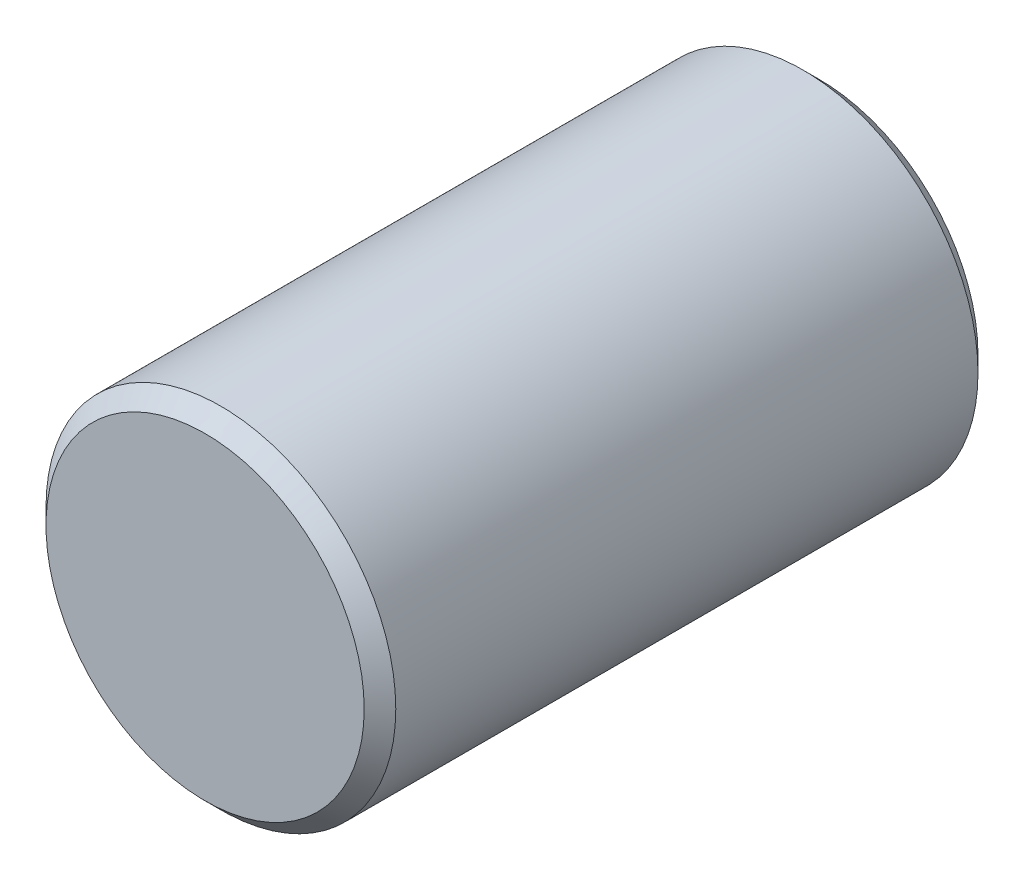
ISO-10303-21;
HEADER;
FILE_DESCRIPTION(('STEP AP214'),'2;1');
FILE_NAME('part.step','',(''),(''),'','','');
FILE_SCHEMA(('AUTOMOTIVE_DESIGN { 1 0 10303 214 1 1 1 1 }'));
ENDSEC;
DATA;
#1=APPLICATION_CONTEXT('core data for automotive mechanical design processes');
#2=APPLICATION_PROTOCOL_DEFINITION('international standard','automotive_design',2000,#1);
#3=PRODUCT_CONTEXT('',#1,'mechanical');
#4=PRODUCT('Part','Part','',(#3));
#5=PRODUCT_RELATED_PRODUCT_CATEGORY('part','',(#4));
#6=PRODUCT_DEFINITION_FORMATION('','',#4);
#7=PRODUCT_DEFINITION_CONTEXT('part definition',#1,'design');
#8=PRODUCT_DEFINITION('design','',#6,#7);
#9=PRODUCT_DEFINITION_SHAPE('','',#8);
#10=(LENGTH_UNIT() NAMED_UNIT(*) SI_UNIT(.MILLI.,.METRE.));
#11=(NAMED_UNIT(*) PLANE_ANGLE_UNIT() SI_UNIT($,.RADIAN.));
#12=(NAMED_UNIT(*) SI_UNIT($,.STERADIAN.) SOLID_ANGLE_UNIT());
#13=UNCERTAINTY_MEASURE_WITH_UNIT(LENGTH_MEASURE(1.E-05),#10,'distance_accuracy_value','');
#14=(GEOMETRIC_REPRESENTATION_CONTEXT(3) GLOBAL_UNCERTAINTY_ASSIGNED_CONTEXT((#13)) GLOBAL_UNIT_ASSIGNED_CONTEXT((#10,
#11,#12)) REPRESENTATION_CONTEXT('',''));
#15=CARTESIAN_POINT('',(0.,0.,0.));
#16=DIRECTION('',(0.,0.,1.));
#17=DIRECTION('',(1.,0.,0.));
#18=AXIS2_PLACEMENT_3D('',#15,#16,#17);
#19=CARTESIAN_POINT('',(0.,0.,13.6));
#20=DIRECTION('',(0.,0.,-1.));
#21=DIRECTION('',(-1.,0.,0.));
#22=AXIS2_PLACEMENT_3D('',#19,#20,#21);
#23=CYLINDRICAL_SURFACE('',#22,3.875);
#24=CARTESIAN_POINT('',(0.,0.,0.350000000000001));
#25=DIRECTION('',(0.,0.,1.));
#26=DIRECTION('',(1.,0.,0.));
#27=AXIS2_PLACEMENT_3D('',#24,#25,#26);
#28=CIRCLE('',#27,3.875);
#29=CARTESIAN_POINT('',(3.875,0.,0.350000000000001));
#30=VERTEX_POINT('',#29);
#31=EDGE_CURVE('E42',#30,#30,#28,.T.);
#32=ORIENTED_EDGE('',*,*,#31,.T.);
#33=EDGE_LOOP('',(#32));
#34=FACE_BOUND('',#33,.T.);
#35=CARTESIAN_POINT('',(0.,0.,13.25));
#36=DIRECTION('',(0.,0.,1.));
#37=DIRECTION('',(1.,0.,0.));
#38=AXIS2_PLACEMENT_3D('',#35,#36,#37);
#39=CIRCLE('',#38,3.875);
#40=CARTESIAN_POINT('',(3.875,0.,13.25));
#41=VERTEX_POINT('',#40);
#42=EDGE_CURVE('E46',#41,#41,#39,.F.);
#43=ORIENTED_EDGE('',*,*,#42,.T.);
#44=EDGE_LOOP('',(#43));
#45=FACE_BOUND('',#44,.T.);
#46=ADVANCED_FACE('F31',(#34,#45),#23,.T.);
#47=CARTESIAN_POINT('',(0.,0.,13.6));
#48=DIRECTION('',(0.,0.,1.));
#49=DIRECTION('',(1.,0.,0.));
#50=AXIS2_PLACEMENT_3D('',#47,#48,#49);
#51=PLANE('',#50);
#52=CARTESIAN_POINT('',(0.,0.,13.6));
#53=DIRECTION('',(0.,0.,1.));
#54=DIRECTION('',(1.,0.,0.));
#55=AXIS2_PLACEMENT_3D('',#52,#53,#54);
#56=CIRCLE('',#55,3.525);
#57=CARTESIAN_POINT('',(3.525,0.,13.6));
#58=VERTEX_POINT('',#57);
#59=EDGE_CURVE('E10',#58,#58,#56,.T.);
#60=ORIENTED_EDGE('',*,*,#59,.T.);
#61=EDGE_LOOP('',(#60));
#62=FACE_BOUND('',#61,.T.);
#63=ADVANCED_FACE('F62',(#62),#51,.T.);
#64=CARTESIAN_POINT('',(0.,0.,0.));
#65=DIRECTION('',(0.,0.,1.));
#66=DIRECTION('',(1.,0.,0.));
#67=AXIS2_PLACEMENT_3D('',#64,#65,#66);
#68=PLANE('',#67);
#69=CARTESIAN_POINT('',(0.,0.,0.));
#70=DIRECTION('',(0.,0.,1.));
#71=DIRECTION('',(1.,0.,0.));
#72=AXIS2_PLACEMENT_3D('',#69,#70,#71);
#73=CIRCLE('',#72,3.525);
#74=CARTESIAN_POINT('',(3.525,0.,0.));
#75=VERTEX_POINT('',#74);
#76=EDGE_CURVE('E38',#75,#75,#73,.F.);
#77=ORIENTED_EDGE('',*,*,#76,.T.);
#78=EDGE_LOOP('',(#77));
#79=FACE_BOUND('',#78,.T.);
#80=ADVANCED_FACE('F59',(#79),#68,.F.);
#81=CARTESIAN_POINT('',(0.,0.,0.350000000000001));
#82=DIRECTION('',(0.,0.,1.));
#83=DIRECTION('',(1.,0.,0.));
#84=AXIS2_PLACEMENT_3D('',#81,#82,#83);
#85=CONICAL_SURFACE('',#84,3.875,0.785398163397453);
#86=ORIENTED_EDGE('',*,*,#76,.F.);
#87=EDGE_LOOP('',(#86));
#88=FACE_BOUND('',#87,.T.);
#89=ORIENTED_EDGE('',*,*,#31,.F.);
#90=EDGE_LOOP('',(#89));
#91=FACE_BOUND('',#90,.T.);
#92=ADVANCED_FACE('F55',(#88,#91),#85,.T.);
#93=CARTESIAN_POINT('',(0.,0.,13.6));
#94=DIRECTION('',(0.,0.,-1.));
#95=DIRECTION('',(-1.,0.,0.));
#96=AXIS2_PLACEMENT_3D('',#93,#94,#95);
#97=CONICAL_SURFACE('',#96,3.525,0.785398163397443);
#98=ORIENTED_EDGE('',*,*,#42,.F.);
#99=EDGE_LOOP('',(#98));
#100=FACE_BOUND('',#99,.T.);
#101=ORIENTED_EDGE('',*,*,#59,.F.);
#102=EDGE_LOOP('',(#101));
#103=FACE_BOUND('',#102,.T.);
#104=ADVANCED_FACE('F33',(#100,#103),#97,.T.);
#105=CLOSED_SHELL('',(#46,#63,#80,#92,#104));
#106=MANIFOLD_SOLID_BREP('B2',#105);
#107=ADVANCED_BREP_SHAPE_REPRESENTATION('',(#18,#106),#14);
#108=SHAPE_DEFINITION_REPRESENTATION(#9,#107);
ENDSEC;
END-ISO-10303-21;
